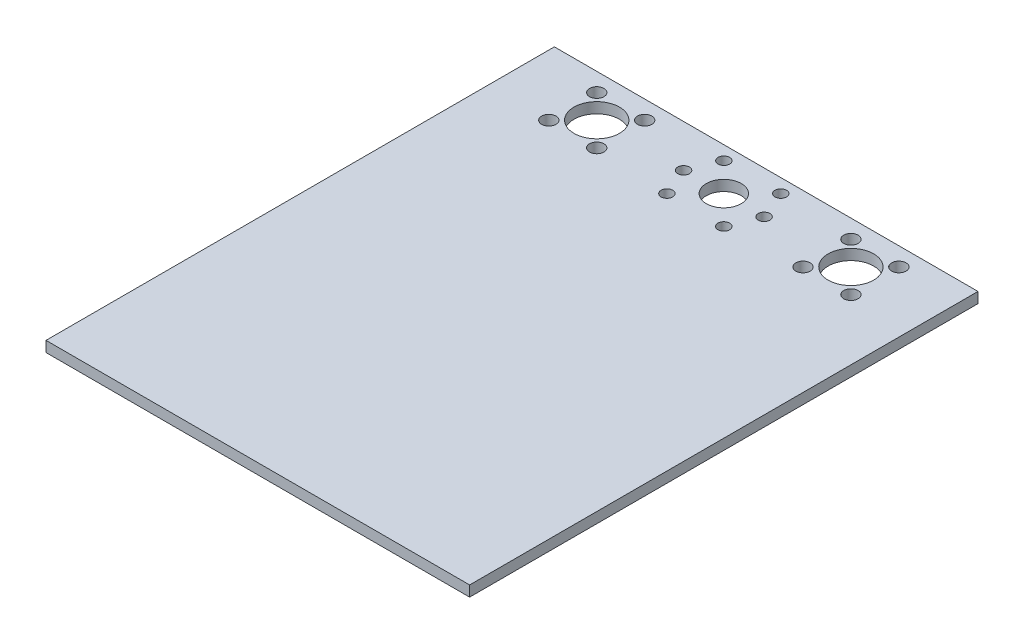
ISO-10303-21;
HEADER;
FILE_DESCRIPTION(('STEP AP214'),'2;1');
FILE_NAME('part.step','',(''),(''),'','','');
FILE_SCHEMA(('AUTOMOTIVE_DESIGN { 1 0 10303 214 1 1 1 1 }'));
ENDSEC;
DATA;
#1=APPLICATION_CONTEXT('core data for automotive mechanical design processes');
#2=APPLICATION_PROTOCOL_DEFINITION('international standard','automotive_design',2000,#1);
#3=PRODUCT_CONTEXT('',#1,'mechanical');
#4=PRODUCT('Part','Part','',(#3));
#5=PRODUCT_RELATED_PRODUCT_CATEGORY('part','',(#4));
#6=PRODUCT_DEFINITION_FORMATION('','',#4);
#7=PRODUCT_DEFINITION_CONTEXT('part definition',#1,'design');
#8=PRODUCT_DEFINITION('design','',#6,#7);
#9=PRODUCT_DEFINITION_SHAPE('','',#8);
#10=(LENGTH_UNIT() NAMED_UNIT(*) SI_UNIT(.MILLI.,.METRE.));
#11=(NAMED_UNIT(*) PLANE_ANGLE_UNIT() SI_UNIT($,.RADIAN.));
#12=(NAMED_UNIT(*) SI_UNIT($,.STERADIAN.) SOLID_ANGLE_UNIT());
#13=UNCERTAINTY_MEASURE_WITH_UNIT(LENGTH_MEASURE(1.E-05),#10,'distance_accuracy_value','');
#14=(GEOMETRIC_REPRESENTATION_CONTEXT(3) GLOBAL_UNCERTAINTY_ASSIGNED_CONTEXT((#13)) GLOBAL_UNIT_ASSIGNED_CONTEXT((#10,
#11,#12)) REPRESENTATION_CONTEXT('',''));
#15=CARTESIAN_POINT('',(0.,0.,0.));
#16=DIRECTION('',(0.,0.,1.));
#17=DIRECTION('',(1.,0.,0.));
#18=AXIS2_PLACEMENT_3D('',#15,#16,#17);
#19=CARTESIAN_POINT('',(0.,5.,0.));
#20=DIRECTION('',(0.,-1.,0.));
#21=DIRECTION('',(0.,0.,-1.));
#22=AXIS2_PLACEMENT_3D('',#19,#20,#21);
#23=PLANE('',#22);
#24=CARTESIAN_POINT('',(71.3137084989848,5.,-111.313708498985));
#25=DIRECTION('',(0.,-1.,0.));
#26=DIRECTION('',(0.,0.,1.));
#27=AXIS2_PLACEMENT_3D('',#24,#25,#26);
#28=CIRCLE('',#27,3.39999999999998);
#29=CARTESIAN_POINT('',(71.3137084989848,5.,-107.913708498985));
#30=VERTEX_POINT('',#29);
#31=EDGE_CURVE('E242',#30,#30,#28,.T.);
#32=ORIENTED_EDGE('',*,*,#31,.T.);
#33=EDGE_LOOP('',(#32));
#34=FACE_BOUND('',#33,.T.);
#35=CARTESIAN_POINT('',(71.3137084989847,5.,-88.6862915010152));
#36=DIRECTION('',(0.,-1.,0.));
#37=DIRECTION('',(0.,0.,1.));
#38=AXIS2_PLACEMENT_3D('',#35,#36,#37);
#39=CIRCLE('',#38,3.4);
#40=CARTESIAN_POINT('',(71.3137084989847,5.,-85.2862915010152));
#41=VERTEX_POINT('',#40);
#42=EDGE_CURVE('E250',#41,#41,#39,.T.);
#43=ORIENTED_EDGE('',*,*,#42,.T.);
#44=EDGE_LOOP('',(#43));
#45=FACE_BOUND('',#44,.T.);
#46=CARTESIAN_POINT('',(48.6862915010152,5.,-88.6862915010153));
#47=DIRECTION('',(0.,-1.,0.));
#48=DIRECTION('',(0.,0.,1.));
#49=AXIS2_PLACEMENT_3D('',#46,#47,#48);
#50=CIRCLE('',#49,3.39999999999999);
#51=CARTESIAN_POINT('',(48.6862915010152,5.,-85.2862915010153));
#52=VERTEX_POINT('',#51);
#53=EDGE_CURVE('E258',#52,#52,#50,.T.);
#54=ORIENTED_EDGE('',*,*,#53,.T.);
#55=EDGE_LOOP('',(#54));
#56=FACE_BOUND('',#55,.T.);
#57=CARTESIAN_POINT('',(48.6862915010152,5.,-111.313708498985));
#58=DIRECTION('',(0.,-1.,0.));
#59=DIRECTION('',(0.,0.,1.));
#60=AXIS2_PLACEMENT_3D('',#57,#58,#59);
#61=CIRCLE('',#60,3.39999999999998);
#62=CARTESIAN_POINT('',(48.6862915010152,5.,-107.913708498985));
#63=VERTEX_POINT('',#62);
#64=EDGE_CURVE('E234',#63,#63,#61,.T.);
#65=ORIENTED_EDGE('',*,*,#64,.T.);
#66=EDGE_LOOP('',(#65));
#67=FACE_BOUND('',#66,.T.);
#68=CARTESIAN_POINT('',(-71.3137084989848,5.,-111.313708498985));
#69=DIRECTION('',(0.,1.,0.));
#70=DIRECTION('',(0.,0.,1.));
#71=AXIS2_PLACEMENT_3D('',#68,#69,#70);
#72=CIRCLE('',#71,3.39999999999998);
#73=CARTESIAN_POINT('',(-71.3137084989848,5.,-107.913708498985));
#74=VERTEX_POINT('',#73);
#75=EDGE_CURVE('E210',#74,#74,#72,.T.);
#76=ORIENTED_EDGE('',*,*,#75,.F.);
#77=EDGE_LOOP('',(#76));
#78=FACE_BOUND('',#77,.T.);
#79=CARTESIAN_POINT('',(-71.3137084989847,5.,-88.6862915010152));
#80=DIRECTION('',(0.,1.,0.));
#81=DIRECTION('',(0.,0.,1.));
#82=AXIS2_PLACEMENT_3D('',#79,#80,#81);
#83=CIRCLE('',#82,3.4);
#84=CARTESIAN_POINT('',(-71.3137084989847,5.,-85.2862915010152));
#85=VERTEX_POINT('',#84);
#86=EDGE_CURVE('E219',#85,#85,#83,.T.);
#87=ORIENTED_EDGE('',*,*,#86,.F.);
#88=EDGE_LOOP('',(#87));
#89=FACE_BOUND('',#88,.T.);
#90=CARTESIAN_POINT('',(-48.6862915010152,5.,-88.6862915010153));
#91=DIRECTION('',(0.,1.,0.));
#92=DIRECTION('',(0.,0.,1.));
#93=AXIS2_PLACEMENT_3D('',#90,#91,#92);
#94=CIRCLE('',#93,3.39999999999999);
#95=CARTESIAN_POINT('',(-48.6862915010152,5.,-85.2862915010153));
#96=VERTEX_POINT('',#95);
#97=EDGE_CURVE('E227',#96,#96,#94,.T.);
#98=ORIENTED_EDGE('',*,*,#97,.F.);
#99=EDGE_LOOP('',(#98));
#100=FACE_BOUND('',#99,.T.);
#101=CARTESIAN_POINT('',(-48.6862915010152,5.,-111.313708498985));
#102=DIRECTION('',(0.,1.,0.));
#103=DIRECTION('',(0.,0.,1.));
#104=AXIS2_PLACEMENT_3D('',#101,#102,#103);
#105=CIRCLE('',#104,3.39999999999998);
#106=CARTESIAN_POINT('',(-48.6862915010152,5.,-107.913708498985));
#107=VERTEX_POINT('',#106);
#108=EDGE_CURVE('E202',#107,#107,#105,.T.);
#109=ORIENTED_EDGE('',*,*,#108,.F.);
#110=EDGE_LOOP('',(#109));
#111=FACE_BOUND('',#110,.T.);
#112=DIRECTION('',(0.,0.,-1.));
#113=VECTOR('',#112,1.);
#114=CARTESIAN_POINT('',(100.,5.,120.));
#115=LINE('',#114,#113);
#116=CARTESIAN_POINT('',(100.,5.,120.));
#117=VERTEX_POINT('',#116);
#118=CARTESIAN_POINT('',(100.,5.,-120.));
#119=VERTEX_POINT('',#118);
#120=EDGE_CURVE('E92',#117,#119,#115,.T.);
#121=ORIENTED_EDGE('',*,*,#120,.T.);
#122=DIRECTION('',(-1.,0.,0.));
#123=VECTOR('',#122,1.);
#124=CARTESIAN_POINT('',(-100.,5.,-120.));
#125=LINE('',#124,#123);
#126=CARTESIAN_POINT('',(-100.,5.,-120.));
#127=VERTEX_POINT('',#126);
#128=EDGE_CURVE('E87',#119,#127,#125,.T.);
#129=ORIENTED_EDGE('',*,*,#128,.T.);
#130=DIRECTION('',(0.,0.,1.));
#131=VECTOR('',#130,1.);
#132=CARTESIAN_POINT('',(-100.,5.,120.));
#133=LINE('',#132,#131);
#134=CARTESIAN_POINT('',(-100.,5.,120.));
#135=VERTEX_POINT('',#134);
#136=EDGE_CURVE('E90',#127,#135,#133,.T.);
#137=ORIENTED_EDGE('',*,*,#136,.T.);
#138=DIRECTION('',(1.,0.,0.));
#139=VECTOR('',#138,1.);
#140=CARTESIAN_POINT('',(-100.,5.,120.));
#141=LINE('',#140,#139);
#142=EDGE_CURVE('E57',#135,#117,#141,.T.);
#143=ORIENTED_EDGE('',*,*,#142,.T.);
#144=EDGE_LOOP('',(#121,#129,#137,#143));
#145=FACE_BOUND('',#144,.T.);
#146=CARTESIAN_POINT('',(0.,5.,-100.));
#147=DIRECTION('',(0.,1.,0.));
#148=DIRECTION('',(0.,0.,1.));
#149=AXIS2_PLACEMENT_3D('',#146,#147,#148);
#150=CIRCLE('',#149,8.25000000000001);
#151=CARTESIAN_POINT('',(0.,5.,-91.75));
#152=VERTEX_POINT('',#151);
#153=EDGE_CURVE('E130',#152,#152,#150,.T.);
#154=ORIENTED_EDGE('',*,*,#153,.F.);
#155=EDGE_LOOP('',(#154));
#156=FACE_BOUND('',#155,.T.);
#157=CARTESIAN_POINT('',(13.4350288425444,5.,-113.435028842544));
#158=DIRECTION('',(0.,1.,0.));
#159=DIRECTION('',(0.,0.,1.));
#160=AXIS2_PLACEMENT_3D('',#157,#158,#159);
#161=CIRCLE('',#160,2.74999999999999);
#162=CARTESIAN_POINT('',(13.4350288425444,5.,-110.685028842544));
#163=VERTEX_POINT('',#162);
#164=EDGE_CURVE('E163',#163,#163,#161,.T.);
#165=ORIENTED_EDGE('',*,*,#164,.F.);
#166=EDGE_LOOP('',(#165));
#167=FACE_BOUND('',#166,.T.);
#168=CARTESIAN_POINT('',(13.4350288425444,5.,-86.5649711574556));
#169=DIRECTION('',(0.,1.,0.));
#170=DIRECTION('',(0.,0.,1.));
#171=AXIS2_PLACEMENT_3D('',#168,#169,#170);
#172=CIRCLE('',#171,2.75);
#173=CARTESIAN_POINT('',(13.4350288425444,5.,-83.8149711574556));
#174=VERTEX_POINT('',#173);
#175=EDGE_CURVE('E155',#174,#174,#172,.T.);
#176=ORIENTED_EDGE('',*,*,#175,.F.);
#177=EDGE_LOOP('',(#176));
#178=FACE_BOUND('',#177,.T.);
#179=CARTESIAN_POINT('',(-13.4350288425444,5.,-86.5649711574556));
#180=DIRECTION('',(0.,1.,0.));
#181=DIRECTION('',(0.,0.,-1.));
#182=AXIS2_PLACEMENT_3D('',#179,#180,#181);
#183=CIRCLE('',#182,2.75);
#184=CARTESIAN_POINT('',(-13.4350288425444,5.,-89.3149711574556));
#185=VERTEX_POINT('',#184);
#186=EDGE_CURVE('E147',#185,#185,#183,.T.);
#187=ORIENTED_EDGE('',*,*,#186,.F.);
#188=EDGE_LOOP('',(#187));
#189=FACE_BOUND('',#188,.T.);
#190=CARTESIAN_POINT('',(-19.,5.,-100.));
#191=DIRECTION('',(0.,1.,0.));
#192=DIRECTION('',(0.,0.,-1.));
#193=AXIS2_PLACEMENT_3D('',#190,#191,#192);
#194=CIRCLE('',#193,2.75);
#195=CARTESIAN_POINT('',(-19.,5.,-102.75));
#196=VERTEX_POINT('',#195);
#197=EDGE_CURVE('E138',#196,#196,#194,.T.);
#198=ORIENTED_EDGE('',*,*,#197,.F.);
#199=EDGE_LOOP('',(#198));
#200=FACE_BOUND('',#199,.T.);
#201=CARTESIAN_POINT('',(-13.4350288425444,5.,-113.435028842544));
#202=DIRECTION('',(0.,1.,0.));
#203=DIRECTION('',(0.,0.,-1.));
#204=AXIS2_PLACEMENT_3D('',#201,#202,#203);
#205=CIRCLE('',#204,2.74999999999999);
#206=CARTESIAN_POINT('',(-13.4350288425444,5.,-116.185028842544));
#207=VERTEX_POINT('',#206);
#208=EDGE_CURVE('E172',#207,#207,#205,.T.);
#209=ORIENTED_EDGE('',*,*,#208,.F.);
#210=EDGE_LOOP('',(#209));
#211=FACE_BOUND('',#210,.T.);
#212=CARTESIAN_POINT('',(19.,5.,-100.));
#213=DIRECTION('',(0.,1.,0.));
#214=DIRECTION('',(0.,0.,1.));
#215=AXIS2_PLACEMENT_3D('',#212,#213,#214);
#216=CIRCLE('',#215,2.75);
#217=CARTESIAN_POINT('',(19.,5.,-97.25));
#218=VERTEX_POINT('',#217);
#219=EDGE_CURVE('E171',#218,#218,#216,.T.);
#220=ORIENTED_EDGE('',*,*,#219,.F.);
#221=EDGE_LOOP('',(#220));
#222=FACE_BOUND('',#221,.T.);
#223=CARTESIAN_POINT('',(60.,5.,-100.));
#224=DIRECTION('',(0.,-1.,0.));
#225=DIRECTION('',(0.,0.,-1.));
#226=AXIS2_PLACEMENT_3D('',#223,#224,#225);
#227=CIRCLE('',#226,10.75);
#228=CARTESIAN_POINT('',(60.,5.,-110.75));
#229=VERTEX_POINT('',#228);
#230=EDGE_CURVE('E190',#229,#229,#227,.T.);
#231=ORIENTED_EDGE('',*,*,#230,.T.);
#232=EDGE_LOOP('',(#231));
#233=FACE_BOUND('',#232,.T.);
#234=CARTESIAN_POINT('',(-60.,5.,-100.));
#235=DIRECTION('',(0.,1.,0.));
#236=DIRECTION('',(0.,0.,1.));
#237=AXIS2_PLACEMENT_3D('',#234,#235,#236);
#238=CIRCLE('',#237,10.75);
#239=CARTESIAN_POINT('',(-60.,5.,-89.25));
#240=VERTEX_POINT('',#239);
#241=EDGE_CURVE('E195',#240,#240,#238,.T.);
#242=ORIENTED_EDGE('',*,*,#241,.F.);
#243=EDGE_LOOP('',(#242));
#244=FACE_BOUND('',#243,.T.);
#245=ADVANCED_FACE('F39',(#34,#45,#56,#67,#78,#89,#100,#111,#145,#156,#167,#178,#189,#200,#211,
#222,#233,#244),#23,.F.);
#246=CARTESIAN_POINT('',(0.,0.,0.));
#247=DIRECTION('',(0.,-1.,0.));
#248=DIRECTION('',(0.,0.,-1.));
#249=AXIS2_PLACEMENT_3D('',#246,#247,#248);
#250=PLANE('',#249);
#251=CARTESIAN_POINT('',(71.3137084989848,0.,-111.313708498985));
#252=DIRECTION('',(0.,-1.,0.));
#253=DIRECTION('',(0.,0.,1.));
#254=AXIS2_PLACEMENT_3D('',#251,#252,#253);
#255=CIRCLE('',#254,3.39999999999998);
#256=CARTESIAN_POINT('',(71.3137084989848,0.,-107.913708498985));
#257=VERTEX_POINT('',#256);
#258=EDGE_CURVE('E246',#257,#257,#255,.T.);
#259=ORIENTED_EDGE('',*,*,#258,.F.);
#260=EDGE_LOOP('',(#259));
#261=FACE_BOUND('',#260,.T.);
#262=CARTESIAN_POINT('',(71.3137084989847,0.,-88.6862915010152));
#263=DIRECTION('',(0.,-1.,0.));
#264=DIRECTION('',(0.,0.,1.));
#265=AXIS2_PLACEMENT_3D('',#262,#263,#264);
#266=CIRCLE('',#265,3.4);
#267=CARTESIAN_POINT('',(71.3137084989847,0.,-85.2862915010152));
#268=VERTEX_POINT('',#267);
#269=EDGE_CURVE('E254',#268,#268,#266,.T.);
#270=ORIENTED_EDGE('',*,*,#269,.F.);
#271=EDGE_LOOP('',(#270));
#272=FACE_BOUND('',#271,.T.);
#273=CARTESIAN_POINT('',(48.6862915010152,0.,-88.6862915010153));
#274=DIRECTION('',(0.,-1.,0.));
#275=DIRECTION('',(0.,0.,1.));
#276=AXIS2_PLACEMENT_3D('',#273,#274,#275);
#277=CIRCLE('',#276,3.39999999999999);
#278=CARTESIAN_POINT('',(48.6862915010152,0.,-85.2862915010153));
#279=VERTEX_POINT('',#278);
#280=EDGE_CURVE('E238',#279,#279,#277,.T.);
#281=ORIENTED_EDGE('',*,*,#280,.F.);
#282=EDGE_LOOP('',(#281));
#283=FACE_BOUND('',#282,.T.);
#284=CARTESIAN_POINT('',(48.6862915010152,0.,-111.313708498985));
#285=DIRECTION('',(0.,-1.,0.));
#286=DIRECTION('',(0.,0.,1.));
#287=AXIS2_PLACEMENT_3D('',#284,#285,#286);
#288=CIRCLE('',#287,3.39999999999998);
#289=CARTESIAN_POINT('',(48.6862915010152,0.,-107.913708498985));
#290=VERTEX_POINT('',#289);
#291=EDGE_CURVE('E215',#290,#290,#288,.T.);
#292=ORIENTED_EDGE('',*,*,#291,.F.);
#293=EDGE_LOOP('',(#292));
#294=FACE_BOUND('',#293,.T.);
#295=CARTESIAN_POINT('',(-71.3137084989848,0.,-111.313708498985));
#296=DIRECTION('',(0.,1.,0.));
#297=DIRECTION('',(0.,0.,1.));
#298=AXIS2_PLACEMENT_3D('',#295,#296,#297);
#299=CIRCLE('',#298,3.39999999999998);
#300=CARTESIAN_POINT('',(-71.3137084989848,0.,-107.913708498985));
#301=VERTEX_POINT('',#300);
#302=EDGE_CURVE('E214',#301,#301,#299,.T.);
#303=ORIENTED_EDGE('',*,*,#302,.T.);
#304=EDGE_LOOP('',(#303));
#305=FACE_BOUND('',#304,.T.);
#306=CARTESIAN_POINT('',(-71.3137084989847,0.,-88.6862915010152));
#307=DIRECTION('',(0.,1.,0.));
#308=DIRECTION('',(0.,0.,1.));
#309=AXIS2_PLACEMENT_3D('',#306,#307,#308);
#310=CIRCLE('',#309,3.4);
#311=CARTESIAN_POINT('',(-71.3137084989847,0.,-85.2862915010152));
#312=VERTEX_POINT('',#311);
#313=EDGE_CURVE('E223',#312,#312,#310,.T.);
#314=ORIENTED_EDGE('',*,*,#313,.T.);
#315=EDGE_LOOP('',(#314));
#316=FACE_BOUND('',#315,.T.);
#317=CARTESIAN_POINT('',(-48.6862915010152,0.,-88.6862915010153));
#318=DIRECTION('',(0.,1.,0.));
#319=DIRECTION('',(0.,0.,1.));
#320=AXIS2_PLACEMENT_3D('',#317,#318,#319);
#321=CIRCLE('',#320,3.39999999999999);
#322=CARTESIAN_POINT('',(-48.6862915010152,0.,-85.2862915010153));
#323=VERTEX_POINT('',#322);
#324=EDGE_CURVE('E206',#323,#323,#321,.T.);
#325=ORIENTED_EDGE('',*,*,#324,.T.);
#326=EDGE_LOOP('',(#325));
#327=FACE_BOUND('',#326,.T.);
#328=CARTESIAN_POINT('',(-48.6862915010152,0.,-111.313708498985));
#329=DIRECTION('',(0.,1.,0.));
#330=DIRECTION('',(0.,0.,1.));
#331=AXIS2_PLACEMENT_3D('',#328,#329,#330);
#332=CIRCLE('',#331,3.39999999999998);
#333=CARTESIAN_POINT('',(-48.6862915010152,0.,-107.913708498985));
#334=VERTEX_POINT('',#333);
#335=EDGE_CURVE('E191',#334,#334,#332,.T.);
#336=ORIENTED_EDGE('',*,*,#335,.T.);
#337=EDGE_LOOP('',(#336));
#338=FACE_BOUND('',#337,.T.);
#339=CARTESIAN_POINT('',(60.,0.,-100.));
#340=DIRECTION('',(0.,-1.,0.));
#341=DIRECTION('',(0.,0.,-1.));
#342=AXIS2_PLACEMENT_3D('',#339,#340,#341);
#343=CIRCLE('',#342,10.75);
#344=CARTESIAN_POINT('',(60.,0.,-110.75));
#345=VERTEX_POINT('',#344);
#346=EDGE_CURVE('E186',#345,#345,#343,.T.);
#347=ORIENTED_EDGE('',*,*,#346,.F.);
#348=EDGE_LOOP('',(#347));
#349=FACE_BOUND('',#348,.T.);
#350=CARTESIAN_POINT('',(19.,0.,-100.));
#351=DIRECTION('',(0.,1.,0.));
#352=DIRECTION('',(0.,0.,1.));
#353=AXIS2_PLACEMENT_3D('',#350,#351,#352);
#354=CIRCLE('',#353,2.75);
#355=CARTESIAN_POINT('',(19.,0.,-97.25));
#356=VERTEX_POINT('',#355);
#357=EDGE_CURVE('E134',#356,#356,#354,.T.);
#358=ORIENTED_EDGE('',*,*,#357,.T.);
#359=EDGE_LOOP('',(#358));
#360=FACE_BOUND('',#359,.T.);
#361=CARTESIAN_POINT('',(-13.4350288425444,0.,-113.435028842544));
#362=DIRECTION('',(0.,1.,0.));
#363=DIRECTION('',(0.,0.,-1.));
#364=AXIS2_PLACEMENT_3D('',#361,#362,#363);
#365=CIRCLE('',#364,2.74999999999999);
#366=CARTESIAN_POINT('',(-13.4350288425444,0.,-116.185028842544));
#367=VERTEX_POINT('',#366);
#368=EDGE_CURVE('E143',#367,#367,#365,.T.);
#369=ORIENTED_EDGE('',*,*,#368,.T.);
#370=EDGE_LOOP('',(#369));
#371=FACE_BOUND('',#370,.T.);
#372=CARTESIAN_POINT('',(-19.,0.,-100.));
#373=DIRECTION('',(0.,1.,0.));
#374=DIRECTION('',(0.,0.,-1.));
#375=AXIS2_PLACEMENT_3D('',#372,#373,#374);
#376=CIRCLE('',#375,2.75);
#377=CARTESIAN_POINT('',(-19.,0.,-102.75));
#378=VERTEX_POINT('',#377);
#379=EDGE_CURVE('E142',#378,#378,#376,.T.);
#380=ORIENTED_EDGE('',*,*,#379,.T.);
#381=EDGE_LOOP('',(#380));
#382=FACE_BOUND('',#381,.T.);
#383=CARTESIAN_POINT('',(-13.4350288425444,0.,-86.5649711574556));
#384=DIRECTION('',(0.,1.,0.));
#385=DIRECTION('',(0.,0.,-1.));
#386=AXIS2_PLACEMENT_3D('',#383,#384,#385);
#387=CIRCLE('',#386,2.75);
#388=CARTESIAN_POINT('',(-13.4350288425444,0.,-89.3149711574556));
#389=VERTEX_POINT('',#388);
#390=EDGE_CURVE('E151',#389,#389,#387,.T.);
#391=ORIENTED_EDGE('',*,*,#390,.T.);
#392=EDGE_LOOP('',(#391));
#393=FACE_BOUND('',#392,.T.);
#394=CARTESIAN_POINT('',(13.4350288425444,0.,-86.5649711574556));
#395=DIRECTION('',(0.,1.,0.));
#396=DIRECTION('',(0.,0.,1.));
#397=AXIS2_PLACEMENT_3D('',#394,#395,#396);
#398=CIRCLE('',#397,2.75);
#399=CARTESIAN_POINT('',(13.4350288425444,0.,-83.8149711574556));
#400=VERTEX_POINT('',#399);
#401=EDGE_CURVE('E159',#400,#400,#398,.T.);
#402=ORIENTED_EDGE('',*,*,#401,.T.);
#403=EDGE_LOOP('',(#402));
#404=FACE_BOUND('',#403,.T.);
#405=CARTESIAN_POINT('',(13.4350288425444,0.,-113.435028842544));
#406=DIRECTION('',(0.,1.,0.));
#407=DIRECTION('',(0.,0.,1.));
#408=AXIS2_PLACEMENT_3D('',#405,#406,#407);
#409=CIRCLE('',#408,2.74999999999999);
#410=CARTESIAN_POINT('',(13.4350288425444,0.,-110.685028842544));
#411=VERTEX_POINT('',#410);
#412=EDGE_CURVE('E167',#411,#411,#409,.T.);
#413=ORIENTED_EDGE('',*,*,#412,.T.);
#414=EDGE_LOOP('',(#413));
#415=FACE_BOUND('',#414,.T.);
#416=CARTESIAN_POINT('',(0.,0.,-100.));
#417=DIRECTION('',(0.,1.,0.));
#418=DIRECTION('',(0.,0.,1.));
#419=AXIS2_PLACEMENT_3D('',#416,#417,#418);
#420=CIRCLE('',#419,8.25000000000001);
#421=CARTESIAN_POINT('',(0.,0.,-91.75));
#422=VERTEX_POINT('',#421);
#423=EDGE_CURVE('E112',#422,#422,#420,.T.);
#424=ORIENTED_EDGE('',*,*,#423,.T.);
#425=EDGE_LOOP('',(#424));
#426=FACE_BOUND('',#425,.T.);
#427=DIRECTION('',(0.,0.,-1.));
#428=VECTOR('',#427,1.);
#429=CARTESIAN_POINT('',(100.,0.,120.));
#430=LINE('',#429,#428);
#431=CARTESIAN_POINT('',(100.,0.,120.));
#432=VERTEX_POINT('',#431);
#433=CARTESIAN_POINT('',(100.,0.,-120.));
#434=VERTEX_POINT('',#433);
#435=EDGE_CURVE('E108',#432,#434,#430,.T.);
#436=ORIENTED_EDGE('',*,*,#435,.F.);
#437=DIRECTION('',(1.,0.,0.));
#438=VECTOR('',#437,1.);
#439=CARTESIAN_POINT('',(-100.,0.,120.));
#440=LINE('',#439,#438);
#441=CARTESIAN_POINT('',(-100.,0.,120.));
#442=VERTEX_POINT('',#441);
#443=EDGE_CURVE('E80',#442,#432,#440,.T.);
#444=ORIENTED_EDGE('',*,*,#443,.F.);
#445=DIRECTION('',(0.,0.,1.));
#446=VECTOR('',#445,1.);
#447=CARTESIAN_POINT('',(-100.,0.,120.));
#448=LINE('',#447,#446);
#449=CARTESIAN_POINT('',(-100.,0.,-120.));
#450=VERTEX_POINT('',#449);
#451=EDGE_CURVE('E74',#450,#442,#448,.T.);
#452=ORIENTED_EDGE('',*,*,#451,.F.);
#453=DIRECTION('',(-1.,0.,0.));
#454=VECTOR('',#453,1.);
#455=CARTESIAN_POINT('',(-100.,0.,-120.));
#456=LINE('',#455,#454);
#457=EDGE_CURVE('E97',#434,#450,#456,.T.);
#458=ORIENTED_EDGE('',*,*,#457,.F.);
#459=EDGE_LOOP('',(#436,#444,#452,#458));
#460=FACE_BOUND('',#459,.T.);
#461=CARTESIAN_POINT('',(-60.,0.,-100.));
#462=DIRECTION('',(0.,1.,0.));
#463=DIRECTION('',(0.,0.,1.));
#464=AXIS2_PLACEMENT_3D('',#461,#462,#463);
#465=CIRCLE('',#464,10.75);
#466=CARTESIAN_POINT('',(-60.,0.,-89.25));
#467=VERTEX_POINT('',#466);
#468=EDGE_CURVE('E176',#467,#467,#465,.T.);
#469=ORIENTED_EDGE('',*,*,#468,.T.);
#470=EDGE_LOOP('',(#469));
#471=FACE_BOUND('',#470,.T.);
#472=ADVANCED_FACE('F125',(#261,#272,#283,#294,#305,#316,#327,#338,#349,#360,#371,#382,#393,
#404,#415,#426,#460,#471),#250,.T.);
#473=CARTESIAN_POINT('',(100.,5.,120.));
#474=DIRECTION('',(-1.,0.,0.));
#475=DIRECTION('',(0.,0.,1.));
#476=AXIS2_PLACEMENT_3D('',#473,#474,#475);
#477=PLANE('',#476);
#478=ORIENTED_EDGE('',*,*,#435,.T.);
#479=DIRECTION('',(0.,-1.,0.));
#480=VECTOR('',#479,1.);
#481=CARTESIAN_POINT('',(100.,5.,-120.));
#482=LINE('',#481,#480);
#483=EDGE_CURVE('E11',#119,#434,#482,.T.);
#484=ORIENTED_EDGE('',*,*,#483,.F.);
#485=ORIENTED_EDGE('',*,*,#120,.F.);
#486=DIRECTION('',(0.,-1.,0.));
#487=VECTOR('',#486,1.);
#488=CARTESIAN_POINT('',(100.,5.,120.));
#489=LINE('',#488,#487);
#490=EDGE_CURVE('E104',#117,#432,#489,.T.);
#491=ORIENTED_EDGE('',*,*,#490,.T.);
#492=EDGE_LOOP('',(#478,#484,#485,#491));
#493=FACE_BOUND('',#492,.T.);
#494=ADVANCED_FACE('F41',(#493),#477,.F.);
#495=CARTESIAN_POINT('',(-100.,5.,-120.));
#496=DIRECTION('',(0.,0.,1.));
#497=DIRECTION('',(1.,0.,0.));
#498=AXIS2_PLACEMENT_3D('',#495,#496,#497);
#499=PLANE('',#498);
#500=ORIENTED_EDGE('',*,*,#457,.T.);
#501=DIRECTION('',(0.,-1.,0.));
#502=VECTOR('',#501,1.);
#503=CARTESIAN_POINT('',(-100.,5.,-120.));
#504=LINE('',#503,#502);
#505=EDGE_CURVE('E49',#127,#450,#504,.T.);
#506=ORIENTED_EDGE('',*,*,#505,.F.);
#507=ORIENTED_EDGE('',*,*,#128,.F.);
#508=ORIENTED_EDGE('',*,*,#483,.T.);
#509=EDGE_LOOP('',(#500,#506,#507,#508));
#510=FACE_BOUND('',#509,.T.);
#511=ADVANCED_FACE('F96',(#510),#499,.F.);
#512=CARTESIAN_POINT('',(-100.,5.,120.));
#513=DIRECTION('',(1.,0.,0.));
#514=DIRECTION('',(0.,0.,-1.));
#515=AXIS2_PLACEMENT_3D('',#512,#513,#514);
#516=PLANE('',#515);
#517=ORIENTED_EDGE('',*,*,#451,.T.);
#518=DIRECTION('',(0.,-1.,0.));
#519=VECTOR('',#518,1.);
#520=CARTESIAN_POINT('',(-100.,5.,120.));
#521=LINE('',#520,#519);
#522=EDGE_CURVE('E99',#135,#442,#521,.T.);
#523=ORIENTED_EDGE('',*,*,#522,.F.);
#524=ORIENTED_EDGE('',*,*,#136,.F.);
#525=ORIENTED_EDGE('',*,*,#505,.T.);
#526=EDGE_LOOP('',(#517,#523,#524,#525));
#527=FACE_BOUND('',#526,.T.);
#528=ADVANCED_FACE('F100',(#527),#516,.F.);
#529=CARTESIAN_POINT('',(-100.,5.,120.));
#530=DIRECTION('',(0.,0.,-1.));
#531=DIRECTION('',(-1.,0.,0.));
#532=AXIS2_PLACEMENT_3D('',#529,#530,#531);
#533=PLANE('',#532);
#534=ORIENTED_EDGE('',*,*,#443,.T.);
#535=ORIENTED_EDGE('',*,*,#490,.F.);
#536=ORIENTED_EDGE('',*,*,#142,.F.);
#537=ORIENTED_EDGE('',*,*,#522,.T.);
#538=EDGE_LOOP('',(#534,#535,#536,#537));
#539=FACE_BOUND('',#538,.T.);
#540=ADVANCED_FACE('F122',(#539),#533,.F.);
#541=CARTESIAN_POINT('',(0.,0.,-100.));
#542=DIRECTION('',(0.,1.,0.));
#543=DIRECTION('',(0.,0.,1.));
#544=AXIS2_PLACEMENT_3D('',#541,#542,#543);
#545=CYLINDRICAL_SURFACE('',#544,8.25000000000001);
#546=ORIENTED_EDGE('',*,*,#423,.F.);
#547=EDGE_LOOP('',(#546));
#548=FACE_BOUND('',#547,.T.);
#549=ORIENTED_EDGE('',*,*,#153,.T.);
#550=EDGE_LOOP('',(#549));
#551=FACE_BOUND('',#550,.T.);
#552=ADVANCED_FACE('F299',(#548,#551),#545,.F.);
#553=CARTESIAN_POINT('',(13.4350288425444,0.,-113.435028842544));
#554=DIRECTION('',(0.,1.,0.));
#555=DIRECTION('',(0.,0.,1.));
#556=AXIS2_PLACEMENT_3D('',#553,#554,#555);
#557=CYLINDRICAL_SURFACE('',#556,2.74999999999999);
#558=ORIENTED_EDGE('',*,*,#412,.F.);
#559=EDGE_LOOP('',(#558));
#560=FACE_BOUND('',#559,.T.);
#561=ORIENTED_EDGE('',*,*,#164,.T.);
#562=EDGE_LOOP('',(#561));
#563=FACE_BOUND('',#562,.T.);
#564=ADVANCED_FACE('F302',(#560,#563),#557,.F.);
#565=CARTESIAN_POINT('',(13.4350288425444,0.,-86.5649711574556));
#566=DIRECTION('',(0.,1.,0.));
#567=DIRECTION('',(0.,0.,1.));
#568=AXIS2_PLACEMENT_3D('',#565,#566,#567);
#569=CYLINDRICAL_SURFACE('',#568,2.75);
#570=ORIENTED_EDGE('',*,*,#401,.F.);
#571=EDGE_LOOP('',(#570));
#572=FACE_BOUND('',#571,.T.);
#573=ORIENTED_EDGE('',*,*,#175,.T.);
#574=EDGE_LOOP('',(#573));
#575=FACE_BOUND('',#574,.T.);
#576=ADVANCED_FACE('F354',(#572,#575),#569,.F.);
#577=CARTESIAN_POINT('',(-13.4350288425444,0.,-86.5649711574556));
#578=DIRECTION('',(0.,1.,0.));
#579=DIRECTION('',(0.,0.,1.));
#580=AXIS2_PLACEMENT_3D('',#577,#578,#579);
#581=CYLINDRICAL_SURFACE('',#580,2.75);
#582=ORIENTED_EDGE('',*,*,#390,.F.);
#583=EDGE_LOOP('',(#582));
#584=FACE_BOUND('',#583,.T.);
#585=ORIENTED_EDGE('',*,*,#186,.T.);
#586=EDGE_LOOP('',(#585));
#587=FACE_BOUND('',#586,.T.);
#588=ADVANCED_FACE('F358',(#584,#587),#581,.F.);
#589=CARTESIAN_POINT('',(-19.,0.,-100.));
#590=DIRECTION('',(0.,1.,0.));
#591=DIRECTION('',(0.,0.,1.));
#592=AXIS2_PLACEMENT_3D('',#589,#590,#591);
#593=CYLINDRICAL_SURFACE('',#592,2.75);
#594=ORIENTED_EDGE('',*,*,#379,.F.);
#595=EDGE_LOOP('',(#594));
#596=FACE_BOUND('',#595,.T.);
#597=ORIENTED_EDGE('',*,*,#197,.T.);
#598=EDGE_LOOP('',(#597));
#599=FACE_BOUND('',#598,.T.);
#600=ADVANCED_FACE('F350',(#596,#599),#593,.F.);
#601=CARTESIAN_POINT('',(-13.4350288425444,0.,-113.435028842544));
#602=DIRECTION('',(0.,1.,0.));
#603=DIRECTION('',(0.,0.,1.));
#604=AXIS2_PLACEMENT_3D('',#601,#602,#603);
#605=CYLINDRICAL_SURFACE('',#604,2.74999999999999);
#606=ORIENTED_EDGE('',*,*,#368,.F.);
#607=EDGE_LOOP('',(#606));
#608=FACE_BOUND('',#607,.T.);
#609=ORIENTED_EDGE('',*,*,#208,.T.);
#610=EDGE_LOOP('',(#609));
#611=FACE_BOUND('',#610,.T.);
#612=ADVANCED_FACE('F346',(#608,#611),#605,.F.);
#613=CARTESIAN_POINT('',(19.,0.,-100.));
#614=DIRECTION('',(0.,1.,0.));
#615=DIRECTION('',(0.,0.,1.));
#616=AXIS2_PLACEMENT_3D('',#613,#614,#615);
#617=CYLINDRICAL_SURFACE('',#616,2.75);
#618=ORIENTED_EDGE('',*,*,#357,.F.);
#619=EDGE_LOOP('',(#618));
#620=FACE_BOUND('',#619,.T.);
#621=ORIENTED_EDGE('',*,*,#219,.T.);
#622=EDGE_LOOP('',(#621));
#623=FACE_BOUND('',#622,.T.);
#624=ADVANCED_FACE('F338',(#620,#623),#617,.F.);
#625=CARTESIAN_POINT('',(60.,0.,-100.));
#626=DIRECTION('',(0.,1.,0.));
#627=DIRECTION('',(0.,0.,1.));
#628=AXIS2_PLACEMENT_3D('',#625,#626,#627);
#629=CYLINDRICAL_SURFACE('',#628,10.75);
#630=ORIENTED_EDGE('',*,*,#346,.T.);
#631=EDGE_LOOP('',(#630));
#632=FACE_BOUND('',#631,.T.);
#633=ORIENTED_EDGE('',*,*,#230,.F.);
#634=EDGE_LOOP('',(#633));
#635=FACE_BOUND('',#634,.T.);
#636=ADVANCED_FACE('F328',(#632,#635),#629,.F.);
#637=CARTESIAN_POINT('',(-60.,0.,-100.));
#638=DIRECTION('',(0.,1.,0.));
#639=DIRECTION('',(0.,0.,1.));
#640=AXIS2_PLACEMENT_3D('',#637,#638,#639);
#641=CYLINDRICAL_SURFACE('',#640,10.75);
#642=ORIENTED_EDGE('',*,*,#468,.F.);
#643=EDGE_LOOP('',(#642));
#644=FACE_BOUND('',#643,.T.);
#645=ORIENTED_EDGE('',*,*,#241,.T.);
#646=EDGE_LOOP('',(#645));
#647=FACE_BOUND('',#646,.T.);
#648=ADVANCED_FACE('F325',(#644,#647),#641,.F.);
#649=CARTESIAN_POINT('',(-48.6862915010152,0.,-111.313708498985));
#650=DIRECTION('',(0.,1.,0.));
#651=DIRECTION('',(0.,0.,1.));
#652=AXIS2_PLACEMENT_3D('',#649,#650,#651);
#653=CYLINDRICAL_SURFACE('',#652,3.39999999999998);
#654=ORIENTED_EDGE('',*,*,#335,.F.);
#655=EDGE_LOOP('',(#654));
#656=FACE_BOUND('',#655,.T.);
#657=ORIENTED_EDGE('',*,*,#108,.T.);
#658=EDGE_LOOP('',(#657));
#659=FACE_BOUND('',#658,.T.);
#660=ADVANCED_FACE('F327',(#656,#659),#653,.F.);
#661=CARTESIAN_POINT('',(-48.6862915010152,0.,-88.6862915010153));
#662=DIRECTION('',(0.,1.,0.));
#663=DIRECTION('',(0.,0.,1.));
#664=AXIS2_PLACEMENT_3D('',#661,#662,#663);
#665=CYLINDRICAL_SURFACE('',#664,3.39999999999999);
#666=ORIENTED_EDGE('',*,*,#324,.F.);
#667=EDGE_LOOP('',(#666));
#668=FACE_BOUND('',#667,.T.);
#669=ORIENTED_EDGE('',*,*,#97,.T.);
#670=EDGE_LOOP('',(#669));
#671=FACE_BOUND('',#670,.T.);
#672=ADVANCED_FACE('F335',(#668,#671),#665,.F.);
#673=CARTESIAN_POINT('',(-71.3137084989847,0.,-88.6862915010152));
#674=DIRECTION('',(0.,1.,0.));
#675=DIRECTION('',(0.,0.,1.));
#676=AXIS2_PLACEMENT_3D('',#673,#674,#675);
#677=CYLINDRICAL_SURFACE('',#676,3.4);
#678=ORIENTED_EDGE('',*,*,#313,.F.);
#679=EDGE_LOOP('',(#678));
#680=FACE_BOUND('',#679,.T.);
#681=ORIENTED_EDGE('',*,*,#86,.T.);
#682=EDGE_LOOP('',(#681));
#683=FACE_BOUND('',#682,.T.);
#684=ADVANCED_FACE('F396',(#680,#683),#677,.F.);
#685=CARTESIAN_POINT('',(-71.3137084989848,0.,-111.313708498985));
#686=DIRECTION('',(0.,1.,0.));
#687=DIRECTION('',(0.,0.,1.));
#688=AXIS2_PLACEMENT_3D('',#685,#686,#687);
#689=CYLINDRICAL_SURFACE('',#688,3.39999999999998);
#690=ORIENTED_EDGE('',*,*,#302,.F.);
#691=EDGE_LOOP('',(#690));
#692=FACE_BOUND('',#691,.T.);
#693=ORIENTED_EDGE('',*,*,#75,.T.);
#694=EDGE_LOOP('',(#693));
#695=FACE_BOUND('',#694,.T.);
#696=ADVANCED_FACE('F390',(#692,#695),#689,.F.);
#697=CARTESIAN_POINT('',(48.6862915010152,0.,-111.313708498985));
#698=DIRECTION('',(0.,1.,0.));
#699=DIRECTION('',(0.,0.,1.));
#700=AXIS2_PLACEMENT_3D('',#697,#698,#699);
#701=CYLINDRICAL_SURFACE('',#700,3.39999999999998);
#702=ORIENTED_EDGE('',*,*,#291,.T.);
#703=EDGE_LOOP('',(#702));
#704=FACE_BOUND('',#703,.T.);
#705=ORIENTED_EDGE('',*,*,#64,.F.);
#706=EDGE_LOOP('',(#705));
#707=FACE_BOUND('',#706,.T.);
#708=ADVANCED_FACE('F395',(#704,#707),#701,.F.);
#709=CARTESIAN_POINT('',(48.6862915010152,0.,-88.6862915010153));
#710=DIRECTION('',(0.,1.,0.));
#711=DIRECTION('',(0.,0.,1.));
#712=AXIS2_PLACEMENT_3D('',#709,#710,#711);
#713=CYLINDRICAL_SURFACE('',#712,3.39999999999999);
#714=ORIENTED_EDGE('',*,*,#280,.T.);
#715=EDGE_LOOP('',(#714));
#716=FACE_BOUND('',#715,.T.);
#717=ORIENTED_EDGE('',*,*,#53,.F.);
#718=EDGE_LOOP('',(#717));
#719=FACE_BOUND('',#718,.T.);
#720=ADVANCED_FACE('F266',(#716,#719),#713,.F.);
#721=CARTESIAN_POINT('',(71.3137084989847,0.,-88.6862915010152));
#722=DIRECTION('',(0.,1.,0.));
#723=DIRECTION('',(0.,0.,1.));
#724=AXIS2_PLACEMENT_3D('',#721,#722,#723);
#725=CYLINDRICAL_SURFACE('',#724,3.4);
#726=ORIENTED_EDGE('',*,*,#269,.T.);
#727=EDGE_LOOP('',(#726));
#728=FACE_BOUND('',#727,.T.);
#729=ORIENTED_EDGE('',*,*,#42,.F.);
#730=EDGE_LOOP('',(#729));
#731=FACE_BOUND('',#730,.T.);
#732=ADVANCED_FACE('F504',(#728,#731),#725,.F.);
#733=CARTESIAN_POINT('',(71.3137084989848,0.,-111.313708498985));
#734=DIRECTION('',(0.,1.,0.));
#735=DIRECTION('',(0.,0.,1.));
#736=AXIS2_PLACEMENT_3D('',#733,#734,#735);
#737=CYLINDRICAL_SURFACE('',#736,3.39999999999998);
#738=ORIENTED_EDGE('',*,*,#258,.T.);
#739=EDGE_LOOP('',(#738));
#740=FACE_BOUND('',#739,.T.);
#741=ORIENTED_EDGE('',*,*,#31,.F.);
#742=EDGE_LOOP('',(#741));
#743=FACE_BOUND('',#742,.T.);
#744=ADVANCED_FACE('F501',(#740,#743),#737,.F.);
#745=CLOSED_SHELL('',(#245,#472,#494,#511,#528,#540,#552,#564,#576,#588,#600,#612,#624,#636,
#648,#660,#672,#684,#696,#708,#720,#732,#744));
#746=MANIFOLD_SOLID_BREP('B2',#745);
#747=ADVANCED_BREP_SHAPE_REPRESENTATION('',(#18,#746),#14);
#748=SHAPE_DEFINITION_REPRESENTATION(#9,#747);
ENDSEC;
END-ISO-10303-21;
